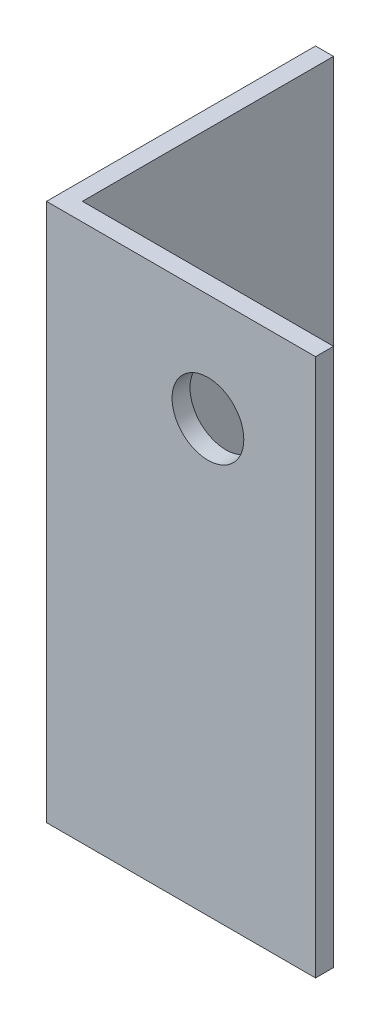
ISO-10303-21;
HEADER;
FILE_DESCRIPTION(('STEP AP214'),'2;1');
FILE_NAME('part.step','',(''),(''),'','','');
FILE_SCHEMA(('AUTOMOTIVE_DESIGN { 1 0 10303 214 1 1 1 1 }'));
ENDSEC;
DATA;
#1=APPLICATION_CONTEXT('core data for automotive mechanical design processes');
#2=APPLICATION_PROTOCOL_DEFINITION('international standard','automotive_design',2000,#1);
#3=PRODUCT_CONTEXT('',#1,'mechanical');
#4=PRODUCT('Part','Part','',(#3));
#5=PRODUCT_RELATED_PRODUCT_CATEGORY('part','',(#4));
#6=PRODUCT_DEFINITION_FORMATION('','',#4);
#7=PRODUCT_DEFINITION_CONTEXT('part definition',#1,'design');
#8=PRODUCT_DEFINITION('design','',#6,#7);
#9=PRODUCT_DEFINITION_SHAPE('','',#8);
#10=(LENGTH_UNIT() NAMED_UNIT(*) SI_UNIT(.MILLI.,.METRE.));
#11=(NAMED_UNIT(*) PLANE_ANGLE_UNIT() SI_UNIT($,.RADIAN.));
#12=(NAMED_UNIT(*) SI_UNIT($,.STERADIAN.) SOLID_ANGLE_UNIT());
#13=UNCERTAINTY_MEASURE_WITH_UNIT(LENGTH_MEASURE(1.E-05),#10,'distance_accuracy_value','');
#14=(GEOMETRIC_REPRESENTATION_CONTEXT(3) GLOBAL_UNCERTAINTY_ASSIGNED_CONTEXT((#13)) GLOBAL_UNIT_ASSIGNED_CONTEXT((#10,
#11,#12)) REPRESENTATION_CONTEXT('',''));
#15=CARTESIAN_POINT('',(0.,0.,0.));
#16=DIRECTION('',(0.,0.,1.));
#17=DIRECTION('',(1.,0.,0.));
#18=AXIS2_PLACEMENT_3D('',#15,#16,#17);
#19=CARTESIAN_POINT('',(0.,150.,0.));
#20=DIRECTION('',(0.,0.,-1.));
#21=DIRECTION('',(-1.,0.,0.));
#22=AXIS2_PLACEMENT_3D('',#19,#20,#21);
#23=PLANE('',#22);
#24=CARTESIAN_POINT('',(45.,120.,0.));
#25=DIRECTION('',(0.,0.,1.));
#26=DIRECTION('',(1.,0.,0.));
#27=AXIS2_PLACEMENT_3D('',#24,#25,#26);
#28=CIRCLE('',#27,10.);
#29=CARTESIAN_POINT('',(55.,120.,0.));
#30=VERTEX_POINT('',#29);
#31=EDGE_CURVE('E165',#30,#30,#28,.T.);
#32=ORIENTED_EDGE('',*,*,#31,.F.);
#33=EDGE_LOOP('',(#32));
#34=FACE_BOUND('',#33,.T.);
#35=DIRECTION('',(1.,0.,0.));
#36=VECTOR('',#35,1.);
#37=CARTESIAN_POINT('',(0.,0.,0.));
#38=LINE('',#37,#36);
#39=CARTESIAN_POINT('',(0.,0.,0.));
#40=VERTEX_POINT('',#39);
#41=CARTESIAN_POINT('',(75.,0.,0.));
#42=VERTEX_POINT('',#41);
#43=EDGE_CURVE('E119',#40,#42,#38,.T.);
#44=ORIENTED_EDGE('',*,*,#43,.T.);
#45=DIRECTION('',(0.,-1.,0.));
#46=VECTOR('',#45,1.);
#47=CARTESIAN_POINT('',(75.,150.,0.));
#48=LINE('',#47,#46);
#49=CARTESIAN_POINT('',(75.,150.,0.));
#50=VERTEX_POINT('',#49);
#51=EDGE_CURVE('E11',#50,#42,#48,.T.);
#52=ORIENTED_EDGE('',*,*,#51,.F.);
#53=DIRECTION('',(1.,0.,0.));
#54=VECTOR('',#53,1.);
#55=CARTESIAN_POINT('',(0.,150.,0.));
#56=LINE('',#55,#54);
#57=CARTESIAN_POINT('',(0.,150.,0.));
#58=VERTEX_POINT('',#57);
#59=EDGE_CURVE('E84',#58,#50,#56,.T.);
#60=ORIENTED_EDGE('',*,*,#59,.F.);
#61=DIRECTION('',(0.,-1.,0.));
#62=VECTOR('',#61,1.);
#63=CARTESIAN_POINT('',(0.,150.,0.));
#64=LINE('',#63,#62);
#65=EDGE_CURVE('E115',#58,#40,#64,.T.);
#66=ORIENTED_EDGE('',*,*,#65,.T.);
#67=EDGE_LOOP('',(#44,#52,#60,#66));
#68=FACE_BOUND('',#67,.T.);
#69=ADVANCED_FACE('F37',(#34,#68),#23,.F.);
#70=CARTESIAN_POINT('',(75.,150.,-5.));
#71=DIRECTION('',(1.,0.,0.));
#72=DIRECTION('',(0.,0.,-1.));
#73=AXIS2_PLACEMENT_3D('',#70,#71,#72);
#74=PLANE('',#73);
#75=DIRECTION('',(0.,0.,1.));
#76=VECTOR('',#75,1.);
#77=CARTESIAN_POINT('',(75.,0.,-5.));
#78=LINE('',#77,#76);
#79=CARTESIAN_POINT('',(75.,0.,-5.));
#80=VERTEX_POINT('',#79);
#81=EDGE_CURVE('E122',#80,#42,#78,.T.);
#82=ORIENTED_EDGE('',*,*,#81,.F.);
#83=DIRECTION('',(0.,-1.,0.));
#84=VECTOR('',#83,1.);
#85=CARTESIAN_POINT('',(75.,150.,-5.));
#86=LINE('',#85,#84);
#87=CARTESIAN_POINT('',(75.,150.,-5.));
#88=VERTEX_POINT('',#87);
#89=EDGE_CURVE('E46',#88,#80,#86,.T.);
#90=ORIENTED_EDGE('',*,*,#89,.F.);
#91=DIRECTION('',(0.,0.,1.));
#92=VECTOR('',#91,1.);
#93=CARTESIAN_POINT('',(75.,150.,-5.));
#94=LINE('',#93,#92);
#95=EDGE_CURVE('E171',#88,#50,#94,.T.);
#96=ORIENTED_EDGE('',*,*,#95,.T.);
#97=ORIENTED_EDGE('',*,*,#51,.T.);
#98=EDGE_LOOP('',(#82,#90,#96,#97));
#99=FACE_BOUND('',#98,.T.);
#100=ADVANCED_FACE('F141',(#99),#74,.T.);
#101=CARTESIAN_POINT('',(0.,150.,-5.));
#102=DIRECTION('',(0.,0.,-1.));
#103=DIRECTION('',(-1.,0.,0.));
#104=AXIS2_PLACEMENT_3D('',#101,#102,#103);
#105=PLANE('',#104);
#106=CARTESIAN_POINT('',(45.,120.,-5.));
#107=DIRECTION('',(0.,0.,-1.));
#108=DIRECTION('',(-1.,0.,0.));
#109=AXIS2_PLACEMENT_3D('',#106,#107,#108);
#110=CIRCLE('',#109,10.);
#111=CARTESIAN_POINT('',(35.,120.,-5.));
#112=VERTEX_POINT('',#111);
#113=EDGE_CURVE('E40',#112,#112,#110,.T.);
#114=ORIENTED_EDGE('',*,*,#113,.F.);
#115=EDGE_LOOP('',(#114));
#116=FACE_BOUND('',#115,.T.);
#117=DIRECTION('',(1.,0.,0.));
#118=VECTOR('',#117,1.);
#119=CARTESIAN_POINT('',(0.,0.,-5.));
#120=LINE('',#119,#118);
#121=CARTESIAN_POINT('',(5.,0.,-5.));
#122=VERTEX_POINT('',#121);
#123=EDGE_CURVE('E125',#122,#80,#120,.T.);
#124=ORIENTED_EDGE('',*,*,#123,.F.);
#125=DIRECTION('',(0.,-1.,0.));
#126=VECTOR('',#125,1.);
#127=CARTESIAN_POINT('',(5.,150.,-5.));
#128=LINE('',#127,#126);
#129=CARTESIAN_POINT('',(5.,150.,-5.));
#130=VERTEX_POINT('',#129);
#131=EDGE_CURVE('E105',#130,#122,#128,.T.);
#132=ORIENTED_EDGE('',*,*,#131,.F.);
#133=DIRECTION('',(1.,0.,0.));
#134=VECTOR('',#133,1.);
#135=CARTESIAN_POINT('',(0.,150.,-5.));
#136=LINE('',#135,#134);
#137=EDGE_CURVE('E111',#130,#88,#136,.T.);
#138=ORIENTED_EDGE('',*,*,#137,.T.);
#139=ORIENTED_EDGE('',*,*,#89,.T.);
#140=EDGE_LOOP('',(#124,#132,#138,#139));
#141=FACE_BOUND('',#140,.T.);
#142=ADVANCED_FACE('F138',(#116,#141),#105,.T.);
#143=CARTESIAN_POINT('',(4.99999999999999,150.,-75.));
#144=DIRECTION('',(1.,0.,0.));
#145=DIRECTION('',(0.,0.,-1.));
#146=AXIS2_PLACEMENT_3D('',#143,#144,#145);
#147=PLANE('',#146);
#148=DIRECTION('',(0.,0.,1.));
#149=VECTOR('',#148,1.);
#150=CARTESIAN_POINT('',(4.99999999999999,0.,-75.));
#151=LINE('',#150,#149);
#152=CARTESIAN_POINT('',(4.99999999999999,0.,-75.));
#153=VERTEX_POINT('',#152);
#154=EDGE_CURVE('E100',#153,#122,#151,.T.);
#155=ORIENTED_EDGE('',*,*,#154,.F.);
#156=DIRECTION('',(0.,-1.,0.));
#157=VECTOR('',#156,1.);
#158=CARTESIAN_POINT('',(4.99999999999999,150.,-75.));
#159=LINE('',#158,#157);
#160=CARTESIAN_POINT('',(4.99999999999999,150.,-75.));
#161=VERTEX_POINT('',#160);
#162=EDGE_CURVE('E95',#161,#153,#159,.T.);
#163=ORIENTED_EDGE('',*,*,#162,.F.);
#164=DIRECTION('',(0.,0.,1.));
#165=VECTOR('',#164,1.);
#166=CARTESIAN_POINT('',(4.99999999999999,150.,-75.));
#167=LINE('',#166,#165);
#168=EDGE_CURVE('E98',#161,#130,#167,.T.);
#169=ORIENTED_EDGE('',*,*,#168,.T.);
#170=ORIENTED_EDGE('',*,*,#131,.T.);
#171=EDGE_LOOP('',(#155,#163,#169,#170));
#172=FACE_BOUND('',#171,.T.);
#173=ADVANCED_FACE('F97',(#172),#147,.T.);
#174=CARTESIAN_POINT('',(0.,150.,-75.));
#175=DIRECTION('',(0.,0.,-1.));
#176=DIRECTION('',(-1.,0.,0.));
#177=AXIS2_PLACEMENT_3D('',#174,#175,#176);
#178=PLANE('',#177);
#179=DIRECTION('',(1.,0.,0.));
#180=VECTOR('',#179,1.);
#181=CARTESIAN_POINT('',(0.,0.,-75.));
#182=LINE('',#181,#180);
#183=CARTESIAN_POINT('',(0.,0.,-75.));
#184=VERTEX_POINT('',#183);
#185=EDGE_CURVE('E129',#184,#153,#182,.T.);
#186=ORIENTED_EDGE('',*,*,#185,.F.);
#187=DIRECTION('',(0.,-1.,0.));
#188=VECTOR('',#187,1.);
#189=CARTESIAN_POINT('',(0.,150.,-75.));
#190=LINE('',#189,#188);
#191=CARTESIAN_POINT('',(0.,150.,-75.));
#192=VERTEX_POINT('',#191);
#193=EDGE_CURVE('E75',#192,#184,#190,.T.);
#194=ORIENTED_EDGE('',*,*,#193,.F.);
#195=DIRECTION('',(1.,0.,0.));
#196=VECTOR('',#195,1.);
#197=CARTESIAN_POINT('',(0.,150.,-75.));
#198=LINE('',#197,#196);
#199=EDGE_CURVE('E109',#192,#161,#198,.T.);
#200=ORIENTED_EDGE('',*,*,#199,.T.);
#201=ORIENTED_EDGE('',*,*,#162,.T.);
#202=EDGE_LOOP('',(#186,#194,#200,#201));
#203=FACE_BOUND('',#202,.T.);
#204=ADVANCED_FACE('F113',(#203),#178,.T.);
#205=CARTESIAN_POINT('',(0.,150.,-75.));
#206=DIRECTION('',(1.,0.,0.));
#207=DIRECTION('',(0.,0.,-1.));
#208=AXIS2_PLACEMENT_3D('',#205,#206,#207);
#209=PLANE('',#208);
#210=DIRECTION('',(0.,0.,1.));
#211=VECTOR('',#210,1.);
#212=CARTESIAN_POINT('',(0.,0.,-75.));
#213=LINE('',#212,#211);
#214=EDGE_CURVE('E78',#184,#40,#213,.T.);
#215=ORIENTED_EDGE('',*,*,#214,.T.);
#216=ORIENTED_EDGE('',*,*,#65,.F.);
#217=DIRECTION('',(0.,0.,1.));
#218=VECTOR('',#217,1.);
#219=CARTESIAN_POINT('',(0.,150.,-75.));
#220=LINE('',#219,#218);
#221=EDGE_CURVE('E54',#192,#58,#220,.T.);
#222=ORIENTED_EDGE('',*,*,#221,.F.);
#223=ORIENTED_EDGE('',*,*,#193,.T.);
#224=EDGE_LOOP('',(#215,#216,#222,#223));
#225=FACE_BOUND('',#224,.T.);
#226=ADVANCED_FACE('F146',(#225),#209,.F.);
#227=CARTESIAN_POINT('',(0.,150.,0.));
#228=DIRECTION('',(0.,-1.,0.));
#229=DIRECTION('',(-1.,0.,0.));
#230=AXIS2_PLACEMENT_3D('',#227,#228,#229);
#231=PLANE('',#230);
#232=ORIENTED_EDGE('',*,*,#59,.T.);
#233=ORIENTED_EDGE('',*,*,#95,.F.);
#234=ORIENTED_EDGE('',*,*,#137,.F.);
#235=ORIENTED_EDGE('',*,*,#168,.F.);
#236=ORIENTED_EDGE('',*,*,#199,.F.);
#237=ORIENTED_EDGE('',*,*,#221,.T.);
#238=EDGE_LOOP('',(#232,#233,#234,#235,#236,#237));
#239=FACE_BOUND('',#238,.T.);
#240=ADVANCED_FACE('F108',(#239),#231,.F.);
#241=CARTESIAN_POINT('',(0.,0.,0.));
#242=DIRECTION('',(0.,-1.,0.));
#243=DIRECTION('',(-1.,0.,0.));
#244=AXIS2_PLACEMENT_3D('',#241,#242,#243);
#245=PLANE('',#244);
#246=ORIENTED_EDGE('',*,*,#43,.F.);
#247=ORIENTED_EDGE('',*,*,#214,.F.);
#248=ORIENTED_EDGE('',*,*,#185,.T.);
#249=ORIENTED_EDGE('',*,*,#154,.T.);
#250=ORIENTED_EDGE('',*,*,#123,.T.);
#251=ORIENTED_EDGE('',*,*,#81,.T.);
#252=EDGE_LOOP('',(#246,#247,#248,#249,#250,#251));
#253=FACE_BOUND('',#252,.T.);
#254=ADVANCED_FACE('F144',(#253),#245,.T.);
#255=CARTESIAN_POINT('',(45.,120.,-75.));
#256=DIRECTION('',(0.,0.,1.));
#257=DIRECTION('',(1.,0.,0.));
#258=AXIS2_PLACEMENT_3D('',#255,#256,#257);
#259=CYLINDRICAL_SURFACE('',#258,10.);
#260=ORIENTED_EDGE('',*,*,#113,.T.);
#261=EDGE_LOOP('',(#260));
#262=FACE_BOUND('',#261,.T.);
#263=ORIENTED_EDGE('',*,*,#31,.T.);
#264=EDGE_LOOP('',(#263));
#265=FACE_BOUND('',#264,.T.);
#266=ADVANCED_FACE('F174',(#262,#265),#259,.F.);
#267=CLOSED_SHELL('',(#69,#100,#142,#173,#204,#226,#240,#254,#266));
#268=MANIFOLD_SOLID_BREP('B2',#267);
#269=ADVANCED_BREP_SHAPE_REPRESENTATION('',(#18,#268),#14);
#270=SHAPE_DEFINITION_REPRESENTATION(#9,#269);
ENDSEC;
END-ISO-10303-21;
